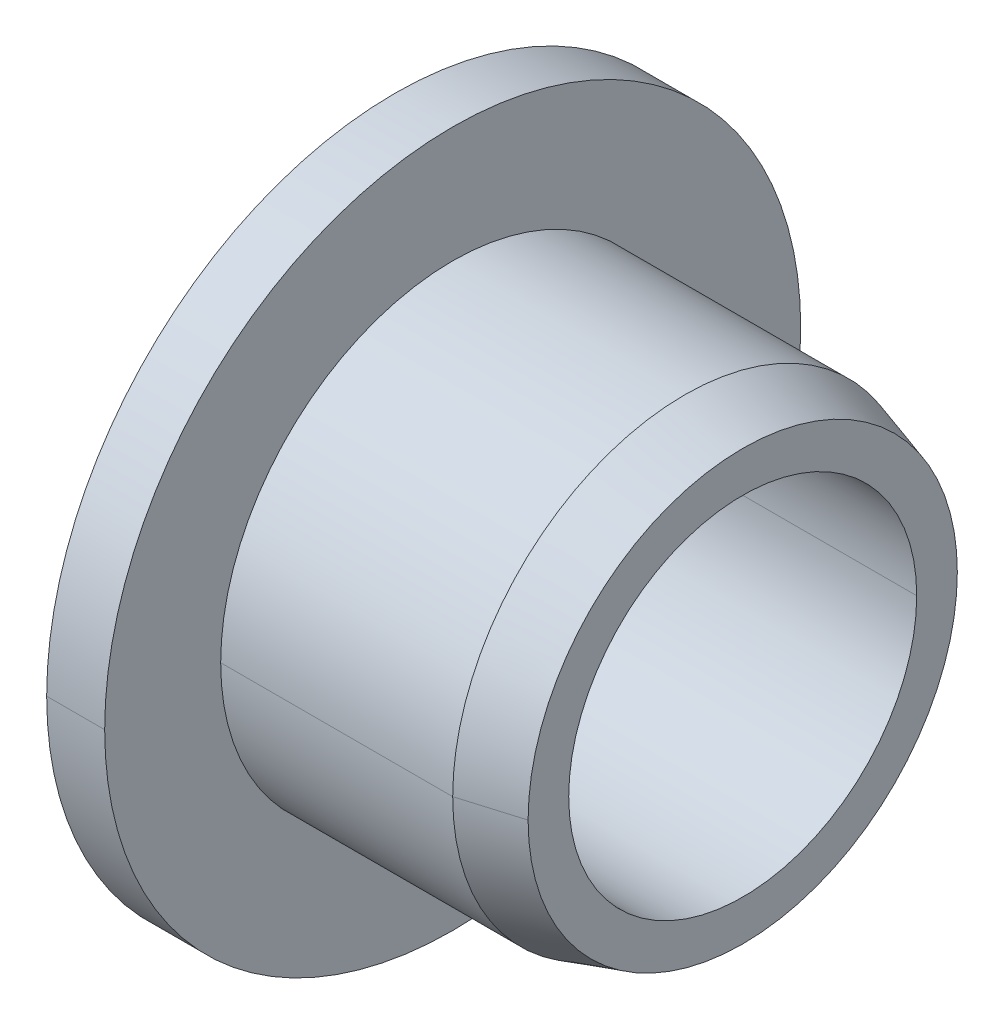
ISO-10303-21;
HEADER;
FILE_DESCRIPTION(('STEP AP214'),'2;1');
FILE_NAME('part.step','',(''),(''),'','','');
FILE_SCHEMA(('AUTOMOTIVE_DESIGN { 1 0 10303 214 1 1 1 1 }'));
ENDSEC;
DATA;
#1=APPLICATION_CONTEXT('core data for automotive mechanical design processes');
#2=APPLICATION_PROTOCOL_DEFINITION('international standard','automotive_design',2000,#1);
#3=PRODUCT_CONTEXT('',#1,'mechanical');
#4=PRODUCT('Part','Part','',(#3));
#5=PRODUCT_RELATED_PRODUCT_CATEGORY('part','',(#4));
#6=PRODUCT_DEFINITION_FORMATION('','',#4);
#7=PRODUCT_DEFINITION_CONTEXT('part definition',#1,'design');
#8=PRODUCT_DEFINITION('design','',#6,#7);
#9=PRODUCT_DEFINITION_SHAPE('','',#8);
#10=(LENGTH_UNIT() NAMED_UNIT(*) SI_UNIT(.MILLI.,.METRE.));
#11=(NAMED_UNIT(*) PLANE_ANGLE_UNIT() SI_UNIT($,.RADIAN.));
#12=(NAMED_UNIT(*) SI_UNIT($,.STERADIAN.) SOLID_ANGLE_UNIT());
#13=UNCERTAINTY_MEASURE_WITH_UNIT(LENGTH_MEASURE(1.E-05),#10,'distance_accuracy_value','');
#14=(GEOMETRIC_REPRESENTATION_CONTEXT(3) GLOBAL_UNCERTAINTY_ASSIGNED_CONTEXT((#13)) GLOBAL_UNIT_ASSIGNED_CONTEXT((#10,
#11,#12)) REPRESENTATION_CONTEXT('',''));
#15=CARTESIAN_POINT('',(0.,0.,0.));
#16=DIRECTION('',(0.,0.,1.));
#17=DIRECTION('',(1.,0.,0.));
#18=AXIS2_PLACEMENT_3D('',#15,#16,#17);
#19=CARTESIAN_POINT('',(0.,6.,0.));
#20=DIRECTION('',(-1.,0.,0.));
#21=DIRECTION('',(0.,0.,1.));
#22=AXIS2_PLACEMENT_3D('',#19,#20,#21);
#23=PLANE('',#22);
#24=CARTESIAN_POINT('',(0.,0.,0.));
#25=DIRECTION('',(1.,0.,0.));
#26=DIRECTION('',(0.,0.,-1.));
#27=AXIS2_PLACEMENT_3D('',#24,#25,#26);
#28=CIRCLE('',#27,3.3);
#29=CARTESIAN_POINT('',(0.,0.,-3.3));
#30=VERTEX_POINT('',#29);
#31=CARTESIAN_POINT('',(0.,0.,3.3));
#32=VERTEX_POINT('',#31);
#33=EDGE_CURVE('E11',#30,#32,#28,.T.);
#34=ORIENTED_EDGE('',*,*,#33,.T.);
#35=CARTESIAN_POINT('',(0.,0.,0.));
#36=DIRECTION('',(1.,0.,0.));
#37=DIRECTION('',(0.,0.,-1.));
#38=AXIS2_PLACEMENT_3D('',#35,#36,#37);
#39=CIRCLE('',#38,3.3);
#40=EDGE_CURVE('E25',#32,#30,#39,.T.);
#41=ORIENTED_EDGE('',*,*,#40,.T.);
#42=EDGE_LOOP('',(#34,#41));
#43=FACE_BOUND('',#42,.T.);
#44=CARTESIAN_POINT('',(0.,0.,0.));
#45=DIRECTION('',(1.,0.,0.));
#46=DIRECTION('',(0.,0.,-1.));
#47=AXIS2_PLACEMENT_3D('',#44,#45,#46);
#48=CIRCLE('',#47,6.);
#49=CARTESIAN_POINT('',(0.,0.,6.));
#50=VERTEX_POINT('',#49);
#51=CARTESIAN_POINT('',(0.,0.,-6.));
#52=VERTEX_POINT('',#51);
#53=EDGE_CURVE('E197',#50,#52,#48,.T.);
#54=ORIENTED_EDGE('',*,*,#53,.F.);
#55=CARTESIAN_POINT('',(0.,0.,0.));
#56=DIRECTION('',(1.,0.,0.));
#57=DIRECTION('',(0.,0.,-1.));
#58=AXIS2_PLACEMENT_3D('',#55,#56,#57);
#59=CIRCLE('',#58,6.);
#60=EDGE_CURVE('E192',#52,#50,#59,.T.);
#61=ORIENTED_EDGE('',*,*,#60,.F.);
#62=EDGE_LOOP('',(#54,#61));
#63=FACE_BOUND('',#62,.T.);
#64=ADVANCED_FACE('F17',(#43,#63),#23,.T.);
#65=CARTESIAN_POINT('',(6.,0.,0.));
#66=DIRECTION('',(1.,0.,0.));
#67=DIRECTION('',(0.,-1.,0.));
#68=AXIS2_PLACEMENT_3D('',#65,#66,#67);
#69=CYLINDRICAL_SURFACE('',#68,6.);
#70=DIRECTION('',(1.,0.,0.));
#71=VECTOR('',#70,1.);
#72=CARTESIAN_POINT('',(0.,0.,6.));
#73=LINE('',#72,#71);
#74=CARTESIAN_POINT('',(1.,0.,6.));
#75=VERTEX_POINT('',#74);
#76=EDGE_CURVE('E188',#50,#75,#73,.T.);
#77=ORIENTED_EDGE('',*,*,#76,.T.);
#78=CARTESIAN_POINT('',(1.,0.,0.));
#79=DIRECTION('',(1.,0.,0.));
#80=DIRECTION('',(0.,0.,-1.));
#81=AXIS2_PLACEMENT_3D('',#78,#79,#80);
#82=CIRCLE('',#81,6.);
#83=CARTESIAN_POINT('',(1.,0.,-6.));
#84=VERTEX_POINT('',#83);
#85=EDGE_CURVE('E183',#84,#75,#82,.T.);
#86=ORIENTED_EDGE('',*,*,#85,.F.);
#87=DIRECTION('',(1.,0.,0.));
#88=VECTOR('',#87,1.);
#89=CARTESIAN_POINT('',(0.,0.,-6.));
#90=LINE('',#89,#88);
#91=EDGE_CURVE('E178',#52,#84,#90,.T.);
#92=ORIENTED_EDGE('',*,*,#91,.F.);
#93=ORIENTED_EDGE('',*,*,#60,.T.);
#94=EDGE_LOOP('',(#77,#86,#92,#93));
#95=FACE_BOUND('',#94,.T.);
#96=ADVANCED_FACE('F213',(#95),#69,.T.);
#97=CARTESIAN_POINT('',(6.,0.,0.));
#98=DIRECTION('',(1.,0.,0.));
#99=DIRECTION('',(0.,1.,0.));
#100=AXIS2_PLACEMENT_3D('',#97,#98,#99);
#101=CYLINDRICAL_SURFACE('',#100,6.);
#102=ORIENTED_EDGE('',*,*,#76,.F.);
#103=ORIENTED_EDGE('',*,*,#53,.T.);
#104=ORIENTED_EDGE('',*,*,#91,.T.);
#105=CARTESIAN_POINT('',(1.,0.,0.));
#106=DIRECTION('',(1.,0.,0.));
#107=DIRECTION('',(0.,0.,-1.));
#108=AXIS2_PLACEMENT_3D('',#105,#106,#107);
#109=CIRCLE('',#108,6.);
#110=EDGE_CURVE('E173',#75,#84,#109,.T.);
#111=ORIENTED_EDGE('',*,*,#110,.F.);
#112=EDGE_LOOP('',(#102,#103,#104,#111));
#113=FACE_BOUND('',#112,.T.);
#114=ADVANCED_FACE('F208',(#113),#101,.T.);
#115=CARTESIAN_POINT('',(1.,4.,0.));
#116=DIRECTION('',(1.,0.,0.));
#117=DIRECTION('',(0.,0.,-1.));
#118=AXIS2_PLACEMENT_3D('',#115,#116,#117);
#119=PLANE('',#118);
#120=ORIENTED_EDGE('',*,*,#85,.T.);
#121=ORIENTED_EDGE('',*,*,#110,.T.);
#122=EDGE_LOOP('',(#120,#121));
#123=FACE_BOUND('',#122,.T.);
#124=CARTESIAN_POINT('',(1.,0.,0.));
#125=DIRECTION('',(1.,0.,0.));
#126=DIRECTION('',(0.,0.,-1.));
#127=AXIS2_PLACEMENT_3D('',#124,#125,#126);
#128=CIRCLE('',#127,4.);
#129=CARTESIAN_POINT('',(1.,0.,4.));
#130=VERTEX_POINT('',#129);
#131=CARTESIAN_POINT('',(1.,0.,-4.));
#132=VERTEX_POINT('',#131);
#133=EDGE_CURVE('E168',#130,#132,#128,.T.);
#134=ORIENTED_EDGE('',*,*,#133,.F.);
#135=CARTESIAN_POINT('',(1.,0.,0.));
#136=DIRECTION('',(1.,0.,0.));
#137=DIRECTION('',(0.,0.,-1.));
#138=AXIS2_PLACEMENT_3D('',#135,#136,#137);
#139=CIRCLE('',#138,4.);
#140=EDGE_CURVE('E163',#132,#130,#139,.T.);
#141=ORIENTED_EDGE('',*,*,#140,.F.);
#142=EDGE_LOOP('',(#134,#141));
#143=FACE_BOUND('',#142,.T.);
#144=ADVANCED_FACE('F215',(#123,#143),#119,.T.);
#145=CARTESIAN_POINT('',(6.,0.,0.));
#146=DIRECTION('',(1.,0.,0.));
#147=DIRECTION('',(0.,-1.,0.));
#148=AXIS2_PLACEMENT_3D('',#145,#146,#147);
#149=CYLINDRICAL_SURFACE('',#148,4.);
#150=DIRECTION('',(1.,0.,0.));
#151=VECTOR('',#150,1.);
#152=CARTESIAN_POINT('',(1.,0.,4.));
#153=LINE('',#152,#151);
#154=CARTESIAN_POINT('',(5.,0.,4.));
#155=VERTEX_POINT('',#154);
#156=EDGE_CURVE('E159',#130,#155,#153,.T.);
#157=ORIENTED_EDGE('',*,*,#156,.T.);
#158=CARTESIAN_POINT('',(5.,0.,0.));
#159=DIRECTION('',(1.,0.,0.));
#160=DIRECTION('',(0.,0.,-1.));
#161=AXIS2_PLACEMENT_3D('',#158,#159,#160);
#162=CIRCLE('',#161,4.);
#163=CARTESIAN_POINT('',(5.,0.,-4.));
#164=VERTEX_POINT('',#163);
#165=EDGE_CURVE('E154',#164,#155,#162,.T.);
#166=ORIENTED_EDGE('',*,*,#165,.F.);
#167=DIRECTION('',(1.,0.,0.));
#168=VECTOR('',#167,1.);
#169=CARTESIAN_POINT('',(1.,0.,-4.));
#170=LINE('',#169,#168);
#171=EDGE_CURVE('E149',#132,#164,#170,.T.);
#172=ORIENTED_EDGE('',*,*,#171,.F.);
#173=ORIENTED_EDGE('',*,*,#140,.T.);
#174=EDGE_LOOP('',(#157,#166,#172,#173));
#175=FACE_BOUND('',#174,.T.);
#176=ADVANCED_FACE('F218',(#175),#149,.T.);
#177=CARTESIAN_POINT('',(6.,0.,0.));
#178=DIRECTION('',(1.,0.,0.));
#179=DIRECTION('',(0.,1.,-5.8935951136395E-10));
#180=AXIS2_PLACEMENT_3D('',#177,#178,#179);
#181=CYLINDRICAL_SURFACE('',#180,4.);
#182=ORIENTED_EDGE('',*,*,#156,.F.);
#183=ORIENTED_EDGE('',*,*,#133,.T.);
#184=ORIENTED_EDGE('',*,*,#171,.T.);
#185=CARTESIAN_POINT('',(5.,0.,0.));
#186=DIRECTION('',(1.,0.,0.));
#187=DIRECTION('',(0.,0.,-1.));
#188=AXIS2_PLACEMENT_3D('',#185,#186,#187);
#189=CIRCLE('',#188,4.);
#190=EDGE_CURVE('E144',#155,#164,#189,.T.);
#191=ORIENTED_EDGE('',*,*,#190,.F.);
#192=EDGE_LOOP('',(#182,#183,#184,#191));
#193=FACE_BOUND('',#192,.T.);
#194=ADVANCED_FACE('F224',(#193),#181,.T.);
#195=CARTESIAN_POINT('',(6.,0.,0.));
#196=DIRECTION('',(-1.,0.,0.));
#197=DIRECTION('',(0.,1.,0.));
#198=AXIS2_PLACEMENT_3D('',#195,#196,#197);
#199=CONICAL_SURFACE('',#198,3.7,0.291456794477867);
#200=DIRECTION('',(-0.957826285221151,0.,-0.287347885566346));
#201=VECTOR('',#200,1.);
#202=CARTESIAN_POINT('',(6.,0.,-3.7));
#203=LINE('',#202,#201);
#204=CARTESIAN_POINT('',(6.,0.,-3.7));
#205=VERTEX_POINT('',#204);
#206=EDGE_CURVE('E139',#205,#164,#203,.T.);
#207=ORIENTED_EDGE('',*,*,#206,.F.);
#208=CARTESIAN_POINT('',(6.,0.,0.));
#209=DIRECTION('',(1.,0.,0.));
#210=DIRECTION('',(0.,0.,-1.));
#211=AXIS2_PLACEMENT_3D('',#208,#209,#210);
#212=CIRCLE('',#211,3.7);
#213=CARTESIAN_POINT('',(6.,0.,3.7));
#214=VERTEX_POINT('',#213);
#215=EDGE_CURVE('E134',#214,#205,#212,.T.);
#216=ORIENTED_EDGE('',*,*,#215,.F.);
#217=DIRECTION('',(-0.957826285221151,0.,0.287347885566346));
#218=VECTOR('',#217,1.);
#219=CARTESIAN_POINT('',(6.,0.,3.7));
#220=LINE('',#219,#218);
#221=EDGE_CURVE('E129',#214,#155,#220,.T.);
#222=ORIENTED_EDGE('',*,*,#221,.T.);
#223=ORIENTED_EDGE('',*,*,#190,.T.);
#224=EDGE_LOOP('',(#207,#216,#222,#223));
#225=FACE_BOUND('',#224,.T.);
#226=ADVANCED_FACE('F227',(#225),#199,.T.);
#227=CARTESIAN_POINT('',(6.,0.,0.));
#228=DIRECTION('',(-1.,0.,0.));
#229=DIRECTION('',(0.,-1.,0.));
#230=AXIS2_PLACEMENT_3D('',#227,#228,#229);
#231=CONICAL_SURFACE('',#230,3.7,0.291456794477867);
#232=ORIENTED_EDGE('',*,*,#206,.T.);
#233=ORIENTED_EDGE('',*,*,#165,.T.);
#234=ORIENTED_EDGE('',*,*,#221,.F.);
#235=CARTESIAN_POINT('',(6.,0.,0.));
#236=DIRECTION('',(1.,0.,0.));
#237=DIRECTION('',(0.,0.,-1.));
#238=AXIS2_PLACEMENT_3D('',#235,#236,#237);
#239=CIRCLE('',#238,3.7);
#240=EDGE_CURVE('E124',#205,#214,#239,.T.);
#241=ORIENTED_EDGE('',*,*,#240,.F.);
#242=EDGE_LOOP('',(#232,#233,#234,#241));
#243=FACE_BOUND('',#242,.T.);
#244=ADVANCED_FACE('F231',(#243),#231,.T.);
#245=CARTESIAN_POINT('',(6.,3.,0.));
#246=DIRECTION('',(1.,0.,0.));
#247=DIRECTION('',(0.,0.,-1.));
#248=AXIS2_PLACEMENT_3D('',#245,#246,#247);
#249=PLANE('',#248);
#250=ORIENTED_EDGE('',*,*,#240,.T.);
#251=ORIENTED_EDGE('',*,*,#215,.T.);
#252=EDGE_LOOP('',(#250,#251));
#253=FACE_BOUND('',#252,.T.);
#254=CARTESIAN_POINT('',(6.,0.,0.));
#255=DIRECTION('',(1.,0.,0.));
#256=DIRECTION('',(0.,0.,-1.));
#257=AXIS2_PLACEMENT_3D('',#254,#255,#256);
#258=CIRCLE('',#257,3.);
#259=CARTESIAN_POINT('',(6.,0.,3.));
#260=VERTEX_POINT('',#259);
#261=CARTESIAN_POINT('',(6.,0.,-3.));
#262=VERTEX_POINT('',#261);
#263=EDGE_CURVE('E95',#260,#262,#258,.T.);
#264=ORIENTED_EDGE('',*,*,#263,.F.);
#265=CARTESIAN_POINT('',(6.,0.,0.));
#266=DIRECTION('',(1.,0.,0.));
#267=DIRECTION('',(0.,0.,-1.));
#268=AXIS2_PLACEMENT_3D('',#265,#266,#267);
#269=CIRCLE('',#268,3.);
#270=EDGE_CURVE('E117',#262,#260,#269,.T.);
#271=ORIENTED_EDGE('',*,*,#270,.F.);
#272=EDGE_LOOP('',(#264,#271));
#273=FACE_BOUND('',#272,.T.);
#274=ADVANCED_FACE('F233',(#253,#273),#249,.T.);
#275=CARTESIAN_POINT('',(6.,0.,0.));
#276=DIRECTION('',(1.,0.,0.));
#277=DIRECTION('',(0.,-1.,0.));
#278=AXIS2_PLACEMENT_3D('',#275,#276,#277);
#279=CYLINDRICAL_SURFACE('',#278,3.);
#280=DIRECTION('',(1.,0.,0.));
#281=VECTOR('',#280,1.);
#282=CARTESIAN_POINT('',(0.3,0.,3.));
#283=LINE('',#282,#281);
#284=CARTESIAN_POINT('',(0.3,0.,3.));
#285=VERTEX_POINT('',#284);
#286=EDGE_CURVE('E85',#285,#260,#283,.T.);
#287=ORIENTED_EDGE('',*,*,#286,.F.);
#288=CARTESIAN_POINT('',(0.3,0.,0.));
#289=DIRECTION('',(1.,0.,0.));
#290=DIRECTION('',(0.,0.,-1.));
#291=AXIS2_PLACEMENT_3D('',#288,#289,#290);
#292=CIRCLE('',#291,3.);
#293=CARTESIAN_POINT('',(0.3,0.,-3.));
#294=VERTEX_POINT('',#293);
#295=EDGE_CURVE('E78',#294,#285,#292,.T.);
#296=ORIENTED_EDGE('',*,*,#295,.F.);
#297=DIRECTION('',(1.,0.,0.));
#298=VECTOR('',#297,1.);
#299=CARTESIAN_POINT('',(0.3,0.,-3.));
#300=LINE('',#299,#298);
#301=EDGE_CURVE('E82',#294,#262,#300,.T.);
#302=ORIENTED_EDGE('',*,*,#301,.T.);
#303=ORIENTED_EDGE('',*,*,#270,.T.);
#304=EDGE_LOOP('',(#287,#296,#302,#303));
#305=FACE_BOUND('',#304,.T.);
#306=ADVANCED_FACE('F80',(#305),#279,.F.);
#307=CARTESIAN_POINT('',(6.,0.,0.));
#308=DIRECTION('',(1.,0.,0.));
#309=DIRECTION('',(0.,1.,-1.61702901641324E-09));
#310=AXIS2_PLACEMENT_3D('',#307,#308,#309);
#311=CYLINDRICAL_SURFACE('',#310,3.);
#312=ORIENTED_EDGE('',*,*,#286,.T.);
#313=ORIENTED_EDGE('',*,*,#263,.T.);
#314=ORIENTED_EDGE('',*,*,#301,.F.);
#315=CARTESIAN_POINT('',(0.3,0.,0.));
#316=DIRECTION('',(1.,0.,0.));
#317=DIRECTION('',(0.,0.,-1.));
#318=AXIS2_PLACEMENT_3D('',#315,#316,#317);
#319=CIRCLE('',#318,3.);
#320=EDGE_CURVE('E93',#285,#294,#319,.T.);
#321=ORIENTED_EDGE('',*,*,#320,.F.);
#322=EDGE_LOOP('',(#312,#313,#314,#321));
#323=FACE_BOUND('',#322,.T.);
#324=ADVANCED_FACE('F92',(#323),#311,.F.);
#325=CARTESIAN_POINT('',(0.,0.,0.));
#326=DIRECTION('',(-1.,0.,0.));
#327=DIRECTION('',(0.,1.,0.));
#328=AXIS2_PLACEMENT_3D('',#325,#326,#327);
#329=CONICAL_SURFACE('',#328,3.3,0.785398163397448);
#330=DIRECTION('',(-0.707106781186548,0.,-0.707106781186548));
#331=VECTOR('',#330,1.);
#332=CARTESIAN_POINT('',(0.3,0.,-3.));
#333=LINE('',#332,#331);
#334=EDGE_CURVE('E99',#294,#30,#333,.T.);
#335=ORIENTED_EDGE('',*,*,#334,.T.);
#336=ORIENTED_EDGE('',*,*,#40,.F.);
#337=DIRECTION('',(-0.707106781186548,0.,0.707106781186548));
#338=VECTOR('',#337,1.);
#339=CARTESIAN_POINT('',(0.3,0.,3.));
#340=LINE('',#339,#338);
#341=EDGE_CURVE('E100',#285,#32,#340,.T.);
#342=ORIENTED_EDGE('',*,*,#341,.F.);
#343=ORIENTED_EDGE('',*,*,#320,.T.);
#344=EDGE_LOOP('',(#335,#336,#342,#343));
#345=FACE_BOUND('',#344,.T.);
#346=ADVANCED_FACE('F98',(#345),#329,.F.);
#347=CARTESIAN_POINT('',(0.,0.,0.));
#348=DIRECTION('',(-1.,0.,0.));
#349=DIRECTION('',(0.,-1.,0.));
#350=AXIS2_PLACEMENT_3D('',#347,#348,#349);
#351=CONICAL_SURFACE('',#350,3.3,0.785398163397448);
#352=ORIENTED_EDGE('',*,*,#334,.F.);
#353=ORIENTED_EDGE('',*,*,#295,.T.);
#354=ORIENTED_EDGE('',*,*,#341,.T.);
#355=ORIENTED_EDGE('',*,*,#33,.F.);
#356=EDGE_LOOP('',(#352,#353,#354,#355));
#357=FACE_BOUND('',#356,.T.);
#358=ADVANCED_FACE('F102',(#357),#351,.F.);
#359=CLOSED_SHELL('',(#64,#96,#114,#144,#176,#194,#226,#244,#274,#306,#324,#346,#358));
#360=MANIFOLD_SOLID_BREP('B1',#359);
#361=ADVANCED_BREP_SHAPE_REPRESENTATION('',(#18,#360),#14);
#362=SHAPE_DEFINITION_REPRESENTATION(#9,#361);
ENDSEC;
END-ISO-10303-21;
